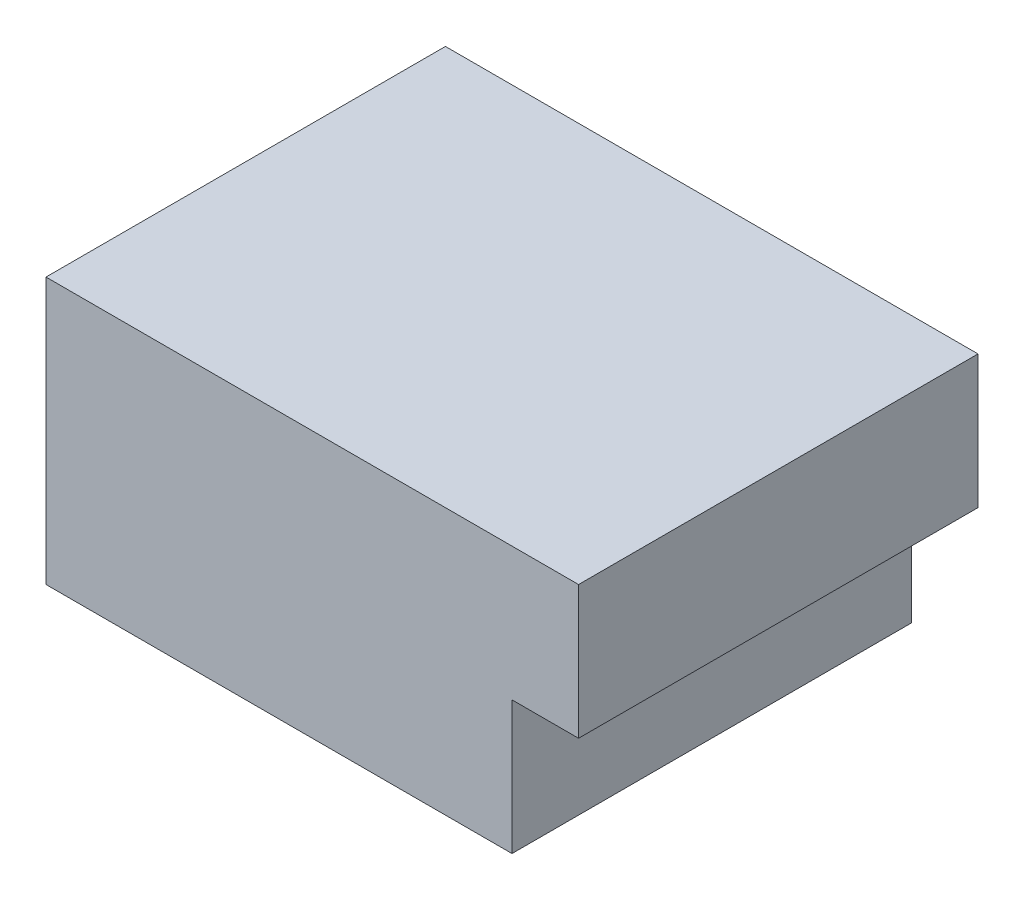
ISO-10303-21;
HEADER;
FILE_DESCRIPTION(('STEP AP214'),'2;1');
FILE_NAME('part.step','',(''),(''),'','','');
FILE_SCHEMA(('AUTOMOTIVE_DESIGN { 1 0 10303 214 1 1 1 1 }'));
ENDSEC;
DATA;
#1=APPLICATION_CONTEXT('core data for automotive mechanical design processes');
#2=APPLICATION_PROTOCOL_DEFINITION('international standard','automotive_design',2000,#1);
#3=PRODUCT_CONTEXT('',#1,'mechanical');
#4=PRODUCT('Part','Part','',(#3));
#5=PRODUCT_RELATED_PRODUCT_CATEGORY('part','',(#4));
#6=PRODUCT_DEFINITION_FORMATION('','',#4);
#7=PRODUCT_DEFINITION_CONTEXT('part definition',#1,'design');
#8=PRODUCT_DEFINITION('design','',#6,#7);
#9=PRODUCT_DEFINITION_SHAPE('','',#8);
#10=(LENGTH_UNIT() NAMED_UNIT(*) SI_UNIT(.MILLI.,.METRE.));
#11=(NAMED_UNIT(*) PLANE_ANGLE_UNIT() SI_UNIT($,.RADIAN.));
#12=(NAMED_UNIT(*) SI_UNIT($,.STERADIAN.) SOLID_ANGLE_UNIT());
#13=UNCERTAINTY_MEASURE_WITH_UNIT(LENGTH_MEASURE(1.E-05),#10,'distance_accuracy_value','');
#14=(GEOMETRIC_REPRESENTATION_CONTEXT(3) GLOBAL_UNCERTAINTY_ASSIGNED_CONTEXT((#13)) GLOBAL_UNIT_ASSIGNED_CONTEXT((#10,
#11,#12)) REPRESENTATION_CONTEXT('',''));
#15=CARTESIAN_POINT('',(0.,0.,0.));
#16=DIRECTION('',(0.,0.,1.));
#17=DIRECTION('',(1.,0.,0.));
#18=AXIS2_PLACEMENT_3D('',#15,#16,#17);
#19=CARTESIAN_POINT('',(0.,0.,0.));
#20=DIRECTION('',(0.,1.,0.));
#21=DIRECTION('',(1.,0.,0.));
#22=AXIS2_PLACEMENT_3D('',#19,#20,#21);
#23=PLANE('',#22);
#24=DIRECTION('',(1.,0.,0.));
#25=VECTOR('',#24,1.);
#26=CARTESIAN_POINT('',(1.6,0.,-0.55));
#27=LINE('',#26,#25);
#28=CARTESIAN_POINT('',(1.6,0.,-0.55));
#29=VERTEX_POINT('',#28);
#30=CARTESIAN_POINT('',(1.95,0.,-0.55));
#31=VERTEX_POINT('',#30);
#32=EDGE_CURVE('E11',#29,#31,#27,.T.);
#33=ORIENTED_EDGE('',*,*,#32,.T.);
#34=DIRECTION('',(0.,0.,-1.));
#35=VECTOR('',#34,1.);
#36=CARTESIAN_POINT('',(1.95,0.,-0.25));
#37=LINE('',#36,#35);
#38=CARTESIAN_POINT('',(1.95,0.,-0.25));
#39=VERTEX_POINT('',#38);
#40=EDGE_CURVE('E115',#39,#31,#37,.T.);
#41=ORIENTED_EDGE('',*,*,#40,.F.);
#42=DIRECTION('',(-1.,0.,0.));
#43=VECTOR('',#42,1.);
#44=CARTESIAN_POINT('',(1.95,0.,-0.25));
#45=LINE('',#44,#43);
#46=CARTESIAN_POINT('',(1.6,0.,-0.25));
#47=VERTEX_POINT('',#46);
#48=EDGE_CURVE('E78',#39,#47,#45,.T.);
#49=ORIENTED_EDGE('',*,*,#48,.T.);
#50=DIRECTION('',(0.,0.,1.));
#51=VECTOR('',#50,1.);
#52=CARTESIAN_POINT('',(1.6,0.,-0.55));
#53=LINE('',#52,#51);
#54=EDGE_CURVE('E106',#29,#47,#53,.T.);
#55=ORIENTED_EDGE('',*,*,#54,.F.);
#56=EDGE_LOOP('',(#33,#41,#49,#55));
#57=FACE_BOUND('',#56,.T.);
#58=ADVANCED_FACE('F17',(#57),#23,.F.);
#59=CARTESIAN_POINT('',(1.6,0.,-0.55));
#60=DIRECTION('',(-1.,0.,0.));
#61=DIRECTION('',(0.,0.,1.));
#62=AXIS2_PLACEMENT_3D('',#59,#60,#61);
#63=PLANE('',#62);
#64=DIRECTION('',(0.,1.,0.));
#65=VECTOR('',#64,1.);
#66=CARTESIAN_POINT('',(1.6,0.,-0.25));
#67=LINE('',#66,#65);
#68=CARTESIAN_POINT('',(1.6,0.2,-0.25));
#69=VERTEX_POINT('',#68);
#70=EDGE_CURVE('E24',#47,#69,#67,.T.);
#71=ORIENTED_EDGE('',*,*,#70,.T.);
#72=DIRECTION('',(0.,0.,-1.));
#73=VECTOR('',#72,1.);
#74=CARTESIAN_POINT('',(1.6,0.2,-0.25));
#75=LINE('',#74,#73);
#76=CARTESIAN_POINT('',(1.6,0.2,-0.55));
#77=VERTEX_POINT('',#76);
#78=EDGE_CURVE('E91',#69,#77,#75,.T.);
#79=ORIENTED_EDGE('',*,*,#78,.T.);
#80=DIRECTION('',(0.,1.,0.));
#81=VECTOR('',#80,1.);
#82=CARTESIAN_POINT('',(1.6,0.,-0.55));
#83=LINE('',#82,#81);
#84=EDGE_CURVE('E108',#29,#77,#83,.T.);
#85=ORIENTED_EDGE('',*,*,#84,.F.);
#86=ORIENTED_EDGE('',*,*,#54,.T.);
#87=EDGE_LOOP('',(#71,#79,#85,#86));
#88=FACE_BOUND('',#87,.T.);
#89=ADVANCED_FACE('F121',(#88),#63,.T.);
#90=CARTESIAN_POINT('',(2.,0.,-0.55));
#91=DIRECTION('',(0.,0.,-1.));
#92=DIRECTION('',(-1.,0.,0.));
#93=AXIS2_PLACEMENT_3D('',#90,#91,#92);
#94=PLANE('',#93);
#95=DIRECTION('',(0.,1.,0.));
#96=VECTOR('',#95,1.);
#97=CARTESIAN_POINT('',(2.,0.1,-0.55));
#98=LINE('',#97,#96);
#99=CARTESIAN_POINT('',(2.,0.1,-0.55));
#100=VERTEX_POINT('',#99);
#101=CARTESIAN_POINT('',(2.,0.2,-0.55));
#102=VERTEX_POINT('',#101);
#103=EDGE_CURVE('E73',#100,#102,#98,.T.);
#104=ORIENTED_EDGE('',*,*,#103,.F.);
#105=DIRECTION('',(-1.,0.,0.));
#106=VECTOR('',#105,1.);
#107=CARTESIAN_POINT('',(2.,0.1,-0.55));
#108=LINE('',#107,#106);
#109=CARTESIAN_POINT('',(1.95,0.1,-0.55));
#110=VERTEX_POINT('',#109);
#111=EDGE_CURVE('E79',#100,#110,#108,.T.);
#112=ORIENTED_EDGE('',*,*,#111,.T.);
#113=DIRECTION('',(0.,1.,0.));
#114=VECTOR('',#113,1.);
#115=CARTESIAN_POINT('',(1.95,0.,-0.55));
#116=LINE('',#115,#114);
#117=EDGE_CURVE('E99',#31,#110,#116,.T.);
#118=ORIENTED_EDGE('',*,*,#117,.F.);
#119=ORIENTED_EDGE('',*,*,#32,.F.);
#120=ORIENTED_EDGE('',*,*,#84,.T.);
#121=DIRECTION('',(1.,0.,0.));
#122=VECTOR('',#121,1.);
#123=CARTESIAN_POINT('',(1.6,0.2,-0.55));
#124=LINE('',#123,#122);
#125=EDGE_CURVE('E102',#77,#102,#124,.T.);
#126=ORIENTED_EDGE('',*,*,#125,.T.);
#127=EDGE_LOOP('',(#104,#112,#118,#119,#120,#126));
#128=FACE_BOUND('',#127,.T.);
#129=ADVANCED_FACE('F123',(#128),#94,.T.);
#130=CARTESIAN_POINT('',(0.,0.2,0.));
#131=DIRECTION('',(0.,1.,0.));
#132=DIRECTION('',(1.,0.,0.));
#133=AXIS2_PLACEMENT_3D('',#130,#131,#132);
#134=PLANE('',#133);
#135=DIRECTION('',(0.,0.,-1.));
#136=VECTOR('',#135,1.);
#137=CARTESIAN_POINT('',(2.,0.2,-0.25));
#138=LINE('',#137,#136);
#139=CARTESIAN_POINT('',(2.,0.2,-0.25));
#140=VERTEX_POINT('',#139);
#141=EDGE_CURVE('E68',#140,#102,#138,.T.);
#142=ORIENTED_EDGE('',*,*,#141,.T.);
#143=ORIENTED_EDGE('',*,*,#125,.F.);
#144=ORIENTED_EDGE('',*,*,#78,.F.);
#145=DIRECTION('',(-1.,0.,0.));
#146=VECTOR('',#145,1.);
#147=CARTESIAN_POINT('',(2.,0.2,-0.25));
#148=LINE('',#147,#146);
#149=EDGE_CURVE('E84',#140,#69,#148,.T.);
#150=ORIENTED_EDGE('',*,*,#149,.F.);
#151=EDGE_LOOP('',(#142,#143,#144,#150));
#152=FACE_BOUND('',#151,.T.);
#153=ADVANCED_FACE('F90',(#152),#134,.T.);
#154=CARTESIAN_POINT('',(1.75,0.,-0.25));
#155=DIRECTION('',(0.,0.,1.));
#156=DIRECTION('',(1.,0.,0.));
#157=AXIS2_PLACEMENT_3D('',#154,#155,#156);
#158=PLANE('',#157);
#159=DIRECTION('',(0.,1.,0.));
#160=VECTOR('',#159,1.);
#161=CARTESIAN_POINT('',(1.95,0.,-0.25));
#162=LINE('',#161,#160);
#163=CARTESIAN_POINT('',(1.95,0.1,-0.25));
#164=VERTEX_POINT('',#163);
#165=EDGE_CURVE('E104',#39,#164,#162,.T.);
#166=ORIENTED_EDGE('',*,*,#165,.T.);
#167=DIRECTION('',(-1.,0.,0.));
#168=VECTOR('',#167,1.);
#169=CARTESIAN_POINT('',(2.,0.1,-0.25));
#170=LINE('',#169,#168);
#171=CARTESIAN_POINT('',(2.,0.1,-0.25));
#172=VERTEX_POINT('',#171);
#173=EDGE_CURVE('E86',#172,#164,#170,.T.);
#174=ORIENTED_EDGE('',*,*,#173,.F.);
#175=DIRECTION('',(0.,1.,0.));
#176=VECTOR('',#175,1.);
#177=CARTESIAN_POINT('',(2.,0.1,-0.25));
#178=LINE('',#177,#176);
#179=EDGE_CURVE('E72',#172,#140,#178,.T.);
#180=ORIENTED_EDGE('',*,*,#179,.T.);
#181=ORIENTED_EDGE('',*,*,#149,.T.);
#182=ORIENTED_EDGE('',*,*,#70,.F.);
#183=ORIENTED_EDGE('',*,*,#48,.F.);
#184=EDGE_LOOP('',(#166,#174,#180,#181,#182,#183));
#185=FACE_BOUND('',#184,.T.);
#186=ADVANCED_FACE('F83',(#185),#158,.T.);
#187=CARTESIAN_POINT('',(2.,0.,-0.25));
#188=DIRECTION('',(1.,0.,0.));
#189=DIRECTION('',(0.,0.,-1.));
#190=AXIS2_PLACEMENT_3D('',#187,#188,#189);
#191=PLANE('',#190);
#192=ORIENTED_EDGE('',*,*,#103,.T.);
#193=ORIENTED_EDGE('',*,*,#141,.F.);
#194=ORIENTED_EDGE('',*,*,#179,.F.);
#195=DIRECTION('',(0.,0.,-1.));
#196=VECTOR('',#195,1.);
#197=CARTESIAN_POINT('',(2.,0.1,-0.25));
#198=LINE('',#197,#196);
#199=EDGE_CURVE('E88',#172,#100,#198,.T.);
#200=ORIENTED_EDGE('',*,*,#199,.T.);
#201=EDGE_LOOP('',(#192,#193,#194,#200));
#202=FACE_BOUND('',#201,.T.);
#203=ADVANCED_FACE('F70',(#202),#191,.T.);
#204=CARTESIAN_POINT('',(2.,0.1,-1.92));
#205=DIRECTION('',(0.,1.,0.));
#206=DIRECTION('',(-1.,0.,0.));
#207=AXIS2_PLACEMENT_3D('',#204,#205,#206);
#208=PLANE('',#207);
#209=ORIENTED_EDGE('',*,*,#199,.F.);
#210=ORIENTED_EDGE('',*,*,#173,.T.);
#211=DIRECTION('',(0.,0.,1.));
#212=VECTOR('',#211,1.);
#213=CARTESIAN_POINT('',(1.95,0.1,-0.55));
#214=LINE('',#213,#212);
#215=EDGE_CURVE('E92',#110,#164,#214,.T.);
#216=ORIENTED_EDGE('',*,*,#215,.F.);
#217=ORIENTED_EDGE('',*,*,#111,.F.);
#218=EDGE_LOOP('',(#209,#210,#216,#217));
#219=FACE_BOUND('',#218,.T.);
#220=ADVANCED_FACE('F127',(#219),#208,.F.);
#221=CARTESIAN_POINT('',(1.95,0.1,-1.92));
#222=DIRECTION('',(-1.,0.,0.));
#223=DIRECTION('',(0.,-1.,0.));
#224=AXIS2_PLACEMENT_3D('',#221,#222,#223);
#225=PLANE('',#224);
#226=ORIENTED_EDGE('',*,*,#215,.T.);
#227=ORIENTED_EDGE('',*,*,#165,.F.);
#228=ORIENTED_EDGE('',*,*,#40,.T.);
#229=ORIENTED_EDGE('',*,*,#117,.T.);
#230=EDGE_LOOP('',(#226,#227,#228,#229));
#231=FACE_BOUND('',#230,.T.);
#232=ADVANCED_FACE('F119',(#231),#225,.F.);
#233=CLOSED_SHELL('',(#58,#89,#129,#153,#186,#203,#220,#232));
#234=MANIFOLD_SOLID_BREP('B1',#233);
#235=ADVANCED_BREP_SHAPE_REPRESENTATION('',(#18,#234),#14);
#236=SHAPE_DEFINITION_REPRESENTATION(#9,#235);
ENDSEC;
END-ISO-10303-21;
